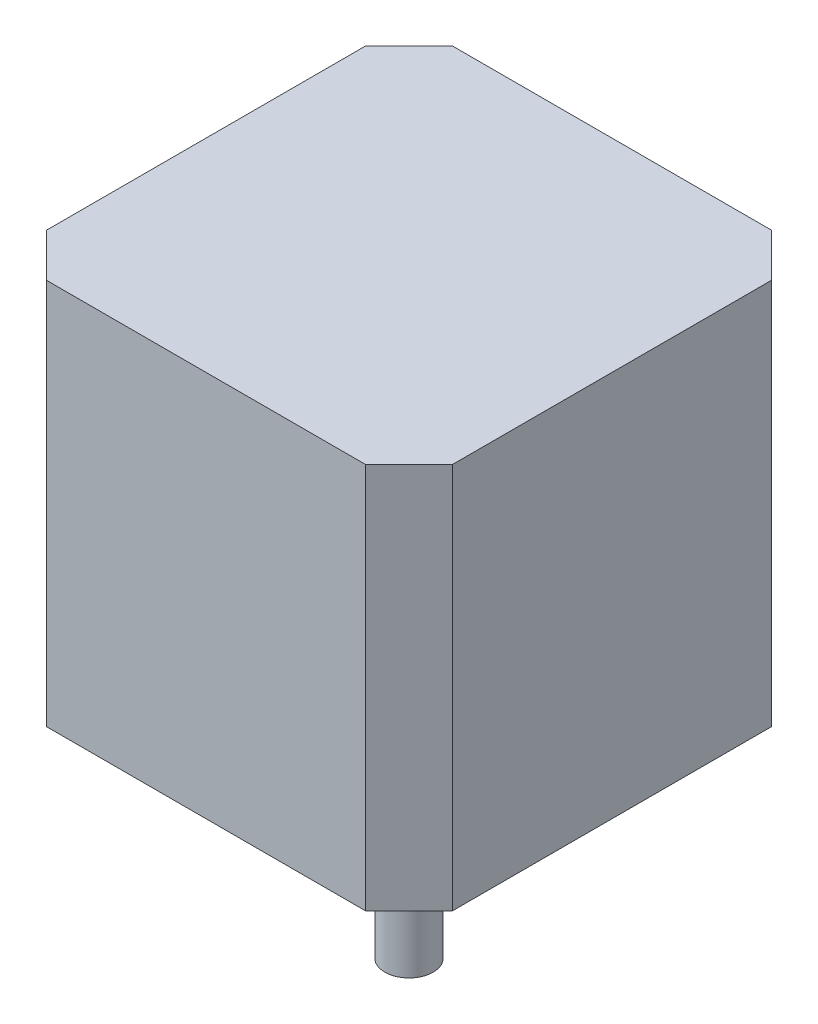
ISO-10303-21;
HEADER;
FILE_DESCRIPTION(('STEP AP214'),'2;1');
FILE_NAME('part.step','',(''),(''),'','','');
FILE_SCHEMA(('AUTOMOTIVE_DESIGN { 1 0 10303 214 1 1 1 1 }'));
ENDSEC;
DATA;
#1=APPLICATION_CONTEXT('core data for automotive mechanical design processes');
#2=APPLICATION_PROTOCOL_DEFINITION('international standard','automotive_design',2000,#1);
#3=PRODUCT_CONTEXT('',#1,'mechanical');
#4=PRODUCT('Part','Part','',(#3));
#5=PRODUCT_RELATED_PRODUCT_CATEGORY('part','',(#4));
#6=PRODUCT_DEFINITION_FORMATION('','',#4);
#7=PRODUCT_DEFINITION_CONTEXT('part definition',#1,'design');
#8=PRODUCT_DEFINITION('design','',#6,#7);
#9=PRODUCT_DEFINITION_SHAPE('','',#8);
#10=(LENGTH_UNIT() NAMED_UNIT(*) SI_UNIT(.MILLI.,.METRE.));
#11=(NAMED_UNIT(*) PLANE_ANGLE_UNIT() SI_UNIT($,.RADIAN.));
#12=(NAMED_UNIT(*) SI_UNIT($,.STERADIAN.) SOLID_ANGLE_UNIT());
#13=UNCERTAINTY_MEASURE_WITH_UNIT(LENGTH_MEASURE(1.E-05),#10,'distance_accuracy_value','');
#14=(GEOMETRIC_REPRESENTATION_CONTEXT(3) GLOBAL_UNCERTAINTY_ASSIGNED_CONTEXT((#13)) GLOBAL_UNIT_ASSIGNED_CONTEXT((#10,
#11,#12)) REPRESENTATION_CONTEXT('',''));
#15=CARTESIAN_POINT('',(0.,0.,0.));
#16=DIRECTION('',(0.,0.,1.));
#17=DIRECTION('',(1.,0.,0.));
#18=AXIS2_PLACEMENT_3D('',#15,#16,#17);
#19=CARTESIAN_POINT('',(21.,40.,21.));
#20=DIRECTION('',(0.,0.,-1.));
#21=DIRECTION('',(-1.,0.,0.));
#22=AXIS2_PLACEMENT_3D('',#19,#20,#21);
#23=PLANE('',#22);
#24=DIRECTION('',(1.,0.,0.));
#25=VECTOR('',#24,1.);
#26=CARTESIAN_POINT('',(21.,0.,21.));
#27=LINE('',#26,#25);
#28=CARTESIAN_POINT('',(-16.5,0.,21.));
#29=VERTEX_POINT('',#28);
#30=CARTESIAN_POINT('',(16.5,0.,21.));
#31=VERTEX_POINT('',#30);
#32=EDGE_CURVE('E155',#29,#31,#27,.T.);
#33=ORIENTED_EDGE('',*,*,#32,.T.);
#34=DIRECTION('',(0.,1.,0.));
#35=VECTOR('',#34,1.);
#36=CARTESIAN_POINT('',(16.5,40.,21.));
#37=LINE('',#36,#35);
#38=CARTESIAN_POINT('',(16.5,40.,21.));
#39=VERTEX_POINT('',#38);
#40=EDGE_CURVE('E194',#31,#39,#37,.T.);
#41=ORIENTED_EDGE('',*,*,#40,.T.);
#42=DIRECTION('',(1.,0.,0.));
#43=VECTOR('',#42,1.);
#44=CARTESIAN_POINT('',(21.,40.,21.));
#45=LINE('',#44,#43);
#46=CARTESIAN_POINT('',(-16.5,40.,21.));
#47=VERTEX_POINT('',#46);
#48=EDGE_CURVE('E158',#47,#39,#45,.T.);
#49=ORIENTED_EDGE('',*,*,#48,.F.);
#50=DIRECTION('',(0.,-1.,0.));
#51=VECTOR('',#50,1.);
#52=CARTESIAN_POINT('',(-16.5,40.,21.));
#53=LINE('',#52,#51);
#54=EDGE_CURVE('E191',#47,#29,#53,.T.);
#55=ORIENTED_EDGE('',*,*,#54,.T.);
#56=EDGE_LOOP('',(#33,#41,#49,#55));
#57=FACE_BOUND('',#56,.T.);
#58=ADVANCED_FACE('F36',(#57),#23,.F.);
#59=CARTESIAN_POINT('',(21.,40.,21.));
#60=DIRECTION('',(-1.,0.,0.));
#61=DIRECTION('',(0.,0.,1.));
#62=AXIS2_PLACEMENT_3D('',#59,#60,#61);
#63=PLANE('',#62);
#64=DIRECTION('',(0.,0.,-1.));
#65=VECTOR('',#64,1.);
#66=CARTESIAN_POINT('',(21.,40.,21.));
#67=LINE('',#66,#65);
#68=CARTESIAN_POINT('',(21.,40.,16.5));
#69=VERTEX_POINT('',#68);
#70=CARTESIAN_POINT('',(21.,40.,-16.5));
#71=VERTEX_POINT('',#70);
#72=EDGE_CURVE('E161',#69,#71,#67,.T.);
#73=ORIENTED_EDGE('',*,*,#72,.F.);
#74=DIRECTION('',(0.,-1.,0.));
#75=VECTOR('',#74,1.);
#76=CARTESIAN_POINT('',(21.,40.,16.5));
#77=LINE('',#76,#75);
#78=CARTESIAN_POINT('',(21.,0.,16.5));
#79=VERTEX_POINT('',#78);
#80=EDGE_CURVE('E180',#69,#79,#77,.T.);
#81=ORIENTED_EDGE('',*,*,#80,.T.);
#82=DIRECTION('',(0.,0.,-1.));
#83=VECTOR('',#82,1.);
#84=CARTESIAN_POINT('',(21.,0.,21.));
#85=LINE('',#84,#83);
#86=CARTESIAN_POINT('',(21.,0.,-16.5));
#87=VERTEX_POINT('',#86);
#88=EDGE_CURVE('E172',#79,#87,#85,.T.);
#89=ORIENTED_EDGE('',*,*,#88,.T.);
#90=DIRECTION('',(0.,1.,0.));
#91=VECTOR('',#90,1.);
#92=CARTESIAN_POINT('',(21.,40.,-16.5));
#93=LINE('',#92,#91);
#94=EDGE_CURVE('E169',#87,#71,#93,.T.);
#95=ORIENTED_EDGE('',*,*,#94,.T.);
#96=EDGE_LOOP('',(#73,#81,#89,#95));
#97=FACE_BOUND('',#96,.T.);
#98=ADVANCED_FACE('F237',(#97),#63,.F.);
#99=CARTESIAN_POINT('',(21.,40.,-21.));
#100=DIRECTION('',(0.,0.,1.));
#101=DIRECTION('',(1.,0.,0.));
#102=AXIS2_PLACEMENT_3D('',#99,#100,#101);
#103=PLANE('',#102);
#104=DIRECTION('',(-1.,0.,0.));
#105=VECTOR('',#104,1.);
#106=CARTESIAN_POINT('',(21.,40.,-21.));
#107=LINE('',#106,#105);
#108=CARTESIAN_POINT('',(16.5,40.,-21.));
#109=VERTEX_POINT('',#108);
#110=CARTESIAN_POINT('',(-16.5,40.,-21.));
#111=VERTEX_POINT('',#110);
#112=EDGE_CURVE('E165',#109,#111,#107,.T.);
#113=ORIENTED_EDGE('',*,*,#112,.F.);
#114=DIRECTION('',(0.,-1.,0.));
#115=VECTOR('',#114,1.);
#116=CARTESIAN_POINT('',(16.5,40.,-21.));
#117=LINE('',#116,#115);
#118=CARTESIAN_POINT('',(16.5,0.,-21.));
#119=VERTEX_POINT('',#118);
#120=EDGE_CURVE('E205',#109,#119,#117,.T.);
#121=ORIENTED_EDGE('',*,*,#120,.T.);
#122=DIRECTION('',(-1.,0.,0.));
#123=VECTOR('',#122,1.);
#124=CARTESIAN_POINT('',(21.,0.,-21.));
#125=LINE('',#124,#123);
#126=CARTESIAN_POINT('',(-16.5,0.,-21.));
#127=VERTEX_POINT('',#126);
#128=EDGE_CURVE('E175',#119,#127,#125,.T.);
#129=ORIENTED_EDGE('',*,*,#128,.T.);
#130=DIRECTION('',(0.,1.,0.));
#131=VECTOR('',#130,1.);
#132=CARTESIAN_POINT('',(-16.5,40.,-21.));
#133=LINE('',#132,#131);
#134=EDGE_CURVE('E203',#127,#111,#133,.T.);
#135=ORIENTED_EDGE('',*,*,#134,.T.);
#136=EDGE_LOOP('',(#113,#121,#129,#135));
#137=FACE_BOUND('',#136,.T.);
#138=ADVANCED_FACE('F211',(#137),#103,.F.);
#139=CARTESIAN_POINT('',(-21.,40.,21.));
#140=DIRECTION('',(1.,0.,0.));
#141=DIRECTION('',(0.,0.,-1.));
#142=AXIS2_PLACEMENT_3D('',#139,#140,#141);
#143=PLANE('',#142);
#144=DIRECTION('',(0.,0.,1.));
#145=VECTOR('',#144,1.);
#146=CARTESIAN_POINT('',(-21.,40.,21.));
#147=LINE('',#146,#145);
#148=CARTESIAN_POINT('',(-21.,40.,-16.5));
#149=VERTEX_POINT('',#148);
#150=CARTESIAN_POINT('',(-21.,40.,16.5));
#151=VERTEX_POINT('',#150);
#152=EDGE_CURVE('E167',#149,#151,#147,.T.);
#153=ORIENTED_EDGE('',*,*,#152,.F.);
#154=DIRECTION('',(0.,-1.,0.));
#155=VECTOR('',#154,1.);
#156=CARTESIAN_POINT('',(-21.,40.,-16.5));
#157=LINE('',#156,#155);
#158=CARTESIAN_POINT('',(-21.,0.,-16.5));
#159=VERTEX_POINT('',#158);
#160=EDGE_CURVE('E11',#149,#159,#157,.T.);
#161=ORIENTED_EDGE('',*,*,#160,.T.);
#162=DIRECTION('',(0.,0.,1.));
#163=VECTOR('',#162,1.);
#164=CARTESIAN_POINT('',(-21.,0.,21.));
#165=LINE('',#164,#163);
#166=CARTESIAN_POINT('',(-21.,0.,16.5));
#167=VERTEX_POINT('',#166);
#168=EDGE_CURVE('E162',#159,#167,#165,.T.);
#169=ORIENTED_EDGE('',*,*,#168,.T.);
#170=DIRECTION('',(0.,1.,0.));
#171=VECTOR('',#170,1.);
#172=CARTESIAN_POINT('',(-21.,40.,16.5));
#173=LINE('',#172,#171);
#174=EDGE_CURVE('E44',#167,#151,#173,.T.);
#175=ORIENTED_EDGE('',*,*,#174,.T.);
#176=EDGE_LOOP('',(#153,#161,#169,#175));
#177=FACE_BOUND('',#176,.T.);
#178=ADVANCED_FACE('F222',(#177),#143,.F.);
#179=CARTESIAN_POINT('',(0.,40.,0.));
#180=DIRECTION('',(0.,-1.,0.));
#181=DIRECTION('',(0.,0.,-1.));
#182=AXIS2_PLACEMENT_3D('',#179,#180,#181);
#183=PLANE('',#182);
#184=ORIENTED_EDGE('',*,*,#48,.T.);
#185=DIRECTION('',(-0.707106781186549,0.,0.707106781186546));
#186=VECTOR('',#185,1.);
#187=CARTESIAN_POINT('',(21.,40.,16.5));
#188=LINE('',#187,#186);
#189=EDGE_CURVE('E201',#39,#69,#188,.F.);
#190=ORIENTED_EDGE('',*,*,#189,.T.);
#191=ORIENTED_EDGE('',*,*,#72,.T.);
#192=DIRECTION('',(0.707106781186545,0.,0.70710678118655));
#193=VECTOR('',#192,1.);
#194=CARTESIAN_POINT('',(16.5,40.,-21.));
#195=LINE('',#194,#193);
#196=EDGE_CURVE('E199',#71,#109,#195,.F.);
#197=ORIENTED_EDGE('',*,*,#196,.T.);
#198=ORIENTED_EDGE('',*,*,#112,.T.);
#199=DIRECTION('',(0.707106781186549,0.,-0.707106781186546));
#200=VECTOR('',#199,1.);
#201=CARTESIAN_POINT('',(-21.,40.,-16.5));
#202=LINE('',#201,#200);
#203=EDGE_CURVE('E57',#111,#149,#202,.F.);
#204=ORIENTED_EDGE('',*,*,#203,.T.);
#205=ORIENTED_EDGE('',*,*,#152,.T.);
#206=DIRECTION('',(-0.707106781186547,0.,-0.707106781186548));
#207=VECTOR('',#206,1.);
#208=CARTESIAN_POINT('',(-16.5,40.,21.));
#209=LINE('',#208,#207);
#210=EDGE_CURVE('E196',#151,#47,#209,.F.);
#211=ORIENTED_EDGE('',*,*,#210,.T.);
#212=EDGE_LOOP('',(#184,#190,#191,#197,#198,#204,#205,#211));
#213=FACE_BOUND('',#212,.T.);
#214=ADVANCED_FACE('F224',(#213),#183,.F.);
#215=CARTESIAN_POINT('',(0.,0.,0.));
#216=DIRECTION('',(0.,-1.,0.));
#217=DIRECTION('',(0.,0.,-1.));
#218=AXIS2_PLACEMENT_3D('',#215,#216,#217);
#219=PLANE('',#218);
#220=CARTESIAN_POINT('',(-15.5,0.,-15.5));
#221=DIRECTION('',(0.,-1.,0.));
#222=DIRECTION('',(0.,0.,-1.));
#223=AXIS2_PLACEMENT_3D('',#220,#221,#222);
#224=CIRCLE('',#223,1.24999999999999);
#225=CARTESIAN_POINT('',(-15.5,0.,-16.75));
#226=VERTEX_POINT('',#225);
#227=EDGE_CURVE('E123',#226,#226,#224,.T.);
#228=ORIENTED_EDGE('',*,*,#227,.F.);
#229=EDGE_LOOP('',(#228));
#230=FACE_BOUND('',#229,.T.);
#231=CARTESIAN_POINT('',(15.5,0.,-15.5));
#232=DIRECTION('',(0.,-1.,0.));
#233=DIRECTION('',(0.,0.,-1.));
#234=AXIS2_PLACEMENT_3D('',#231,#232,#233);
#235=CIRCLE('',#234,1.24999999999999);
#236=CARTESIAN_POINT('',(15.5,0.,-16.75));
#237=VERTEX_POINT('',#236);
#238=EDGE_CURVE('E122',#237,#237,#235,.T.);
#239=ORIENTED_EDGE('',*,*,#238,.F.);
#240=EDGE_LOOP('',(#239));
#241=FACE_BOUND('',#240,.T.);
#242=CARTESIAN_POINT('',(15.5,0.,15.5));
#243=DIRECTION('',(0.,-1.,0.));
#244=DIRECTION('',(0.,0.,-1.));
#245=AXIS2_PLACEMENT_3D('',#242,#243,#244);
#246=CIRCLE('',#245,1.24999999999999);
#247=CARTESIAN_POINT('',(15.5,0.,14.25));
#248=VERTEX_POINT('',#247);
#249=EDGE_CURVE('E133',#248,#248,#246,.T.);
#250=ORIENTED_EDGE('',*,*,#249,.F.);
#251=EDGE_LOOP('',(#250));
#252=FACE_BOUND('',#251,.T.);
#253=CARTESIAN_POINT('',(-15.5,0.,15.5));
#254=DIRECTION('',(0.,-1.,0.));
#255=DIRECTION('',(0.,0.,-1.));
#256=AXIS2_PLACEMENT_3D('',#253,#254,#255);
#257=CIRCLE('',#256,1.24999999999999);
#258=CARTESIAN_POINT('',(-15.5,0.,14.25));
#259=VERTEX_POINT('',#258);
#260=EDGE_CURVE('E139',#259,#259,#257,.T.);
#261=ORIENTED_EDGE('',*,*,#260,.F.);
#262=EDGE_LOOP('',(#261));
#263=FACE_BOUND('',#262,.T.);
#264=CARTESIAN_POINT('',(0.,0.,0.));
#265=DIRECTION('',(0.,-1.,0.));
#266=DIRECTION('',(0.,0.,-1.));
#267=AXIS2_PLACEMENT_3D('',#264,#265,#266);
#268=CIRCLE('',#267,11.);
#269=CARTESIAN_POINT('',(0.,0.,-11.));
#270=VERTEX_POINT('',#269);
#271=EDGE_CURVE('E149',#270,#270,#268,.T.);
#272=ORIENTED_EDGE('',*,*,#271,.F.);
#273=EDGE_LOOP('',(#272));
#274=FACE_BOUND('',#273,.T.);
#275=ORIENTED_EDGE('',*,*,#88,.F.);
#276=DIRECTION('',(0.707106781186549,0.,-0.707106781186546));
#277=VECTOR('',#276,1.);
#278=CARTESIAN_POINT('',(18.75,0.,18.75));
#279=LINE('',#278,#277);
#280=EDGE_CURVE('E189',#79,#31,#279,.F.);
#281=ORIENTED_EDGE('',*,*,#280,.T.);
#282=ORIENTED_EDGE('',*,*,#32,.F.);
#283=DIRECTION('',(0.707106781186547,0.,0.707106781186548));
#284=VECTOR('',#283,1.);
#285=CARTESIAN_POINT('',(-18.75,0.,18.75));
#286=LINE('',#285,#284);
#287=EDGE_CURVE('E183',#29,#167,#286,.F.);
#288=ORIENTED_EDGE('',*,*,#287,.T.);
#289=ORIENTED_EDGE('',*,*,#168,.F.);
#290=DIRECTION('',(-0.707106781186549,0.,0.707106781186546));
#291=VECTOR('',#290,1.);
#292=CARTESIAN_POINT('',(-18.75,0.,-18.75));
#293=LINE('',#292,#291);
#294=EDGE_CURVE('E185',#159,#127,#293,.F.);
#295=ORIENTED_EDGE('',*,*,#294,.T.);
#296=ORIENTED_EDGE('',*,*,#128,.F.);
#297=DIRECTION('',(-0.707106781186545,0.,-0.70710678118655));
#298=VECTOR('',#297,1.);
#299=CARTESIAN_POINT('',(18.7500000000001,0.,-18.7499999999999));
#300=LINE('',#299,#298);
#301=EDGE_CURVE('E187',#119,#87,#300,.F.);
#302=ORIENTED_EDGE('',*,*,#301,.T.);
#303=EDGE_LOOP('',(#275,#281,#282,#288,#289,#295,#296,#302));
#304=FACE_BOUND('',#303,.T.);
#305=ADVANCED_FACE('F217',(#230,#241,#252,#263,#274,#304),#219,.T.);
#306=CARTESIAN_POINT('',(0.,-2.,0.));
#307=DIRECTION('',(0.,1.,0.));
#308=DIRECTION('',(0.,0.,1.));
#309=AXIS2_PLACEMENT_3D('',#306,#307,#308);
#310=CYLINDRICAL_SURFACE('',#309,11.);
#311=CARTESIAN_POINT('',(0.,-2.,0.));
#312=DIRECTION('',(0.,-1.,0.));
#313=DIRECTION('',(0.,0.,-1.));
#314=AXIS2_PLACEMENT_3D('',#311,#312,#313);
#315=CIRCLE('',#314,11.);
#316=CARTESIAN_POINT('',(0.,-2.,-11.));
#317=VERTEX_POINT('',#316);
#318=EDGE_CURVE('E152',#317,#317,#315,.T.);
#319=ORIENTED_EDGE('',*,*,#318,.F.);
#320=EDGE_LOOP('',(#319));
#321=FACE_BOUND('',#320,.T.);
#322=ORIENTED_EDGE('',*,*,#271,.T.);
#323=EDGE_LOOP('',(#322));
#324=FACE_BOUND('',#323,.T.);
#325=ADVANCED_FACE('F261',(#321,#324),#310,.T.);
#326=CARTESIAN_POINT('',(0.,-2.,0.));
#327=DIRECTION('',(0.,-1.,0.));
#328=DIRECTION('',(0.,0.,-1.));
#329=AXIS2_PLACEMENT_3D('',#326,#327,#328);
#330=PLANE('',#329);
#331=CARTESIAN_POINT('',(0.,-2.,0.));
#332=DIRECTION('',(0.,-1.,0.));
#333=DIRECTION('',(0.,0.,-1.));
#334=AXIS2_PLACEMENT_3D('',#331,#332,#333);
#335=CIRCLE('',#334,2.5);
#336=CARTESIAN_POINT('',(0.,-2.,-2.5));
#337=VERTEX_POINT('',#336);
#338=EDGE_CURVE('E145',#337,#337,#335,.T.);
#339=ORIENTED_EDGE('',*,*,#338,.F.);
#340=EDGE_LOOP('',(#339));
#341=FACE_BOUND('',#340,.T.);
#342=ORIENTED_EDGE('',*,*,#318,.T.);
#343=EDGE_LOOP('',(#342));
#344=FACE_BOUND('',#343,.T.);
#345=ADVANCED_FACE('F267',(#341,#344),#330,.T.);
#346=CARTESIAN_POINT('',(0.,-23.,0.));
#347=DIRECTION('',(0.,1.,0.));
#348=DIRECTION('',(0.,0.,1.));
#349=AXIS2_PLACEMENT_3D('',#346,#347,#348);
#350=CYLINDRICAL_SURFACE('',#349,2.5);
#351=CARTESIAN_POINT('',(0.,-23.,0.));
#352=DIRECTION('',(0.,-1.,0.));
#353=DIRECTION('',(0.,0.,-1.));
#354=AXIS2_PLACEMENT_3D('',#351,#352,#353);
#355=CIRCLE('',#354,2.5);
#356=CARTESIAN_POINT('',(0.,-23.,-2.5));
#357=VERTEX_POINT('',#356);
#358=EDGE_CURVE('E146',#357,#357,#355,.T.);
#359=ORIENTED_EDGE('',*,*,#358,.F.);
#360=EDGE_LOOP('',(#359));
#361=FACE_BOUND('',#360,.T.);
#362=ORIENTED_EDGE('',*,*,#338,.T.);
#363=EDGE_LOOP('',(#362));
#364=FACE_BOUND('',#363,.T.);
#365=ADVANCED_FACE('F271',(#361,#364),#350,.T.);
#366=CARTESIAN_POINT('',(0.,-23.,0.));
#367=DIRECTION('',(0.,-1.,0.));
#368=DIRECTION('',(0.,0.,-1.));
#369=AXIS2_PLACEMENT_3D('',#366,#367,#368);
#370=PLANE('',#369);
#371=ORIENTED_EDGE('',*,*,#358,.T.);
#372=EDGE_LOOP('',(#371));
#373=FACE_BOUND('',#372,.T.);
#374=ADVANCED_FACE('F246',(#373),#370,.T.);
#375=CARTESIAN_POINT('',(21.,40.,16.5));
#376=DIRECTION('',(-0.707106781186546,0.,-0.707106781186549));
#377=DIRECTION('',(0.,-1.,0.));
#378=AXIS2_PLACEMENT_3D('',#375,#376,#377);
#379=PLANE('',#378);
#380=ORIENTED_EDGE('',*,*,#189,.F.);
#381=ORIENTED_EDGE('',*,*,#40,.F.);
#382=ORIENTED_EDGE('',*,*,#280,.F.);
#383=ORIENTED_EDGE('',*,*,#80,.F.);
#384=EDGE_LOOP('',(#380,#381,#382,#383));
#385=FACE_BOUND('',#384,.T.);
#386=ADVANCED_FACE('F234',(#385),#379,.F.);
#387=CARTESIAN_POINT('',(16.5,40.,-21.));
#388=DIRECTION('',(-0.70710678118655,0.,0.707106781186545));
#389=DIRECTION('',(0.,-1.,0.));
#390=AXIS2_PLACEMENT_3D('',#387,#388,#389);
#391=PLANE('',#390);
#392=ORIENTED_EDGE('',*,*,#196,.F.);
#393=ORIENTED_EDGE('',*,*,#94,.F.);
#394=ORIENTED_EDGE('',*,*,#301,.F.);
#395=ORIENTED_EDGE('',*,*,#120,.F.);
#396=EDGE_LOOP('',(#392,#393,#394,#395));
#397=FACE_BOUND('',#396,.T.);
#398=ADVANCED_FACE('F239',(#397),#391,.F.);
#399=CARTESIAN_POINT('',(-21.,40.,-16.5));
#400=DIRECTION('',(0.707106781186546,0.,0.707106781186549));
#401=DIRECTION('',(0.,-1.,0.));
#402=AXIS2_PLACEMENT_3D('',#399,#400,#401);
#403=PLANE('',#402);
#404=ORIENTED_EDGE('',*,*,#203,.F.);
#405=ORIENTED_EDGE('',*,*,#134,.F.);
#406=ORIENTED_EDGE('',*,*,#294,.F.);
#407=ORIENTED_EDGE('',*,*,#160,.F.);
#408=EDGE_LOOP('',(#404,#405,#406,#407));
#409=FACE_BOUND('',#408,.T.);
#410=ADVANCED_FACE('F221',(#409),#403,.F.);
#411=CARTESIAN_POINT('',(-16.5,40.,21.));
#412=DIRECTION('',(0.707106781186548,0.,-0.707106781186547));
#413=DIRECTION('',(0.,-1.,0.));
#414=AXIS2_PLACEMENT_3D('',#411,#412,#413);
#415=PLANE('',#414);
#416=ORIENTED_EDGE('',*,*,#210,.F.);
#417=ORIENTED_EDGE('',*,*,#174,.F.);
#418=ORIENTED_EDGE('',*,*,#287,.F.);
#419=ORIENTED_EDGE('',*,*,#54,.F.);
#420=EDGE_LOOP('',(#416,#417,#418,#419));
#421=FACE_BOUND('',#420,.T.);
#422=ADVANCED_FACE('F38',(#421),#415,.F.);
#423=CARTESIAN_POINT('',(-15.5,6.,15.5));
#424=DIRECTION('',(0.,-1.,0.));
#425=DIRECTION('',(0.,0.,-1.));
#426=AXIS2_PLACEMENT_3D('',#423,#424,#425);
#427=CONICAL_SURFACE('',#426,1.25,1.02974425867665);
#428=CARTESIAN_POINT('',(-15.5,6.75107577378445,15.5));
#429=VERTEX_POINT('',#428);
#430=VERTEX_LOOP('',#429);
#431=FACE_BOUND('',#430,.T.);
#432=CARTESIAN_POINT('',(-15.5,6.,15.5));
#433=DIRECTION('',(0.,-1.,0.));
#434=DIRECTION('',(0.,0.,-1.));
#435=AXIS2_PLACEMENT_3D('',#432,#433,#434);
#436=CIRCLE('',#435,1.25);
#437=CARTESIAN_POINT('',(-15.5,6.,14.25));
#438=VERTEX_POINT('',#437);
#439=EDGE_CURVE('E142',#438,#438,#436,.T.);
#440=ORIENTED_EDGE('',*,*,#439,.T.);
#441=EDGE_LOOP('',(#440));
#442=FACE_BOUND('',#441,.T.);
#443=ADVANCED_FACE('F279',(#431,#442),#427,.F.);
#444=CARTESIAN_POINT('',(-15.5,0.,15.5));
#445=DIRECTION('',(0.,-1.,0.));
#446=DIRECTION('',(0.,0.,-1.));
#447=AXIS2_PLACEMENT_3D('',#444,#445,#446);
#448=CYLINDRICAL_SURFACE('',#447,1.24999999999999);
#449=ORIENTED_EDGE('',*,*,#439,.F.);
#450=EDGE_LOOP('',(#449));
#451=FACE_BOUND('',#450,.T.);
#452=ORIENTED_EDGE('',*,*,#260,.T.);
#453=EDGE_LOOP('',(#452));
#454=FACE_BOUND('',#453,.T.);
#455=ADVANCED_FACE('F282',(#451,#454),#448,.F.);
#456=CARTESIAN_POINT('',(15.5,6.,15.5));
#457=DIRECTION('',(0.,-1.,0.));
#458=DIRECTION('',(0.,0.,-1.));
#459=AXIS2_PLACEMENT_3D('',#456,#457,#458);
#460=CONICAL_SURFACE('',#459,1.25,1.02974425867665);
#461=CARTESIAN_POINT('',(15.5,6.75107577378445,15.5));
#462=VERTEX_POINT('',#461);
#463=VERTEX_LOOP('',#462);
#464=FACE_BOUND('',#463,.T.);
#465=CARTESIAN_POINT('',(15.5,6.,15.5));
#466=DIRECTION('',(0.,-1.,0.));
#467=DIRECTION('',(0.,0.,-1.));
#468=AXIS2_PLACEMENT_3D('',#465,#466,#467);
#469=CIRCLE('',#468,1.25);
#470=CARTESIAN_POINT('',(15.5,6.,14.25));
#471=VERTEX_POINT('',#470);
#472=EDGE_CURVE('E136',#471,#471,#469,.T.);
#473=ORIENTED_EDGE('',*,*,#472,.T.);
#474=EDGE_LOOP('',(#473));
#475=FACE_BOUND('',#474,.T.);
#476=ADVANCED_FACE('F286',(#464,#475),#460,.F.);
#477=CARTESIAN_POINT('',(15.5,0.,15.5));
#478=DIRECTION('',(0.,-1.,0.));
#479=DIRECTION('',(0.,0.,-1.));
#480=AXIS2_PLACEMENT_3D('',#477,#478,#479);
#481=CYLINDRICAL_SURFACE('',#480,1.24999999999999);
#482=ORIENTED_EDGE('',*,*,#472,.F.);
#483=EDGE_LOOP('',(#482));
#484=FACE_BOUND('',#483,.T.);
#485=ORIENTED_EDGE('',*,*,#249,.T.);
#486=EDGE_LOOP('',(#485));
#487=FACE_BOUND('',#486,.T.);
#488=ADVANCED_FACE('F290',(#484,#487),#481,.F.);
#489=CARTESIAN_POINT('',(15.5,6.,-15.5));
#490=DIRECTION('',(0.,-1.,0.));
#491=DIRECTION('',(0.,0.,-1.));
#492=AXIS2_PLACEMENT_3D('',#489,#490,#491);
#493=CONICAL_SURFACE('',#492,1.25,1.02974425867665);
#494=CARTESIAN_POINT('',(15.5,6.75107577378445,-15.5));
#495=VERTEX_POINT('',#494);
#496=VERTEX_LOOP('',#495);
#497=FACE_BOUND('',#496,.T.);
#498=CARTESIAN_POINT('',(15.5,6.,-15.5));
#499=DIRECTION('',(0.,-1.,0.));
#500=DIRECTION('',(0.,0.,-1.));
#501=AXIS2_PLACEMENT_3D('',#498,#499,#500);
#502=CIRCLE('',#501,1.25);
#503=CARTESIAN_POINT('',(15.5,6.,-16.75));
#504=VERTEX_POINT('',#503);
#505=EDGE_CURVE('E126',#504,#504,#502,.T.);
#506=ORIENTED_EDGE('',*,*,#505,.T.);
#507=EDGE_LOOP('',(#506));
#508=FACE_BOUND('',#507,.T.);
#509=ADVANCED_FACE('F294',(#497,#508),#493,.F.);
#510=CARTESIAN_POINT('',(15.5,0.,-15.5));
#511=DIRECTION('',(0.,-1.,0.));
#512=DIRECTION('',(0.,0.,-1.));
#513=AXIS2_PLACEMENT_3D('',#510,#511,#512);
#514=CYLINDRICAL_SURFACE('',#513,1.24999999999999);
#515=ORIENTED_EDGE('',*,*,#505,.F.);
#516=EDGE_LOOP('',(#515));
#517=FACE_BOUND('',#516,.T.);
#518=ORIENTED_EDGE('',*,*,#238,.T.);
#519=EDGE_LOOP('',(#518));
#520=FACE_BOUND('',#519,.T.);
#521=ADVANCED_FACE('F116',(#517,#520),#514,.F.);
#522=CARTESIAN_POINT('',(-15.5,6.,-15.5));
#523=DIRECTION('',(0.,-1.,0.));
#524=DIRECTION('',(0.,0.,-1.));
#525=AXIS2_PLACEMENT_3D('',#522,#523,#524);
#526=CONICAL_SURFACE('',#525,1.25,1.02974425867665);
#527=CARTESIAN_POINT('',(-15.5,6.75107577378445,-15.5));
#528=VERTEX_POINT('',#527);
#529=VERTEX_LOOP('',#528);
#530=FACE_BOUND('',#529,.T.);
#531=CARTESIAN_POINT('',(-15.5,6.,-15.5));
#532=DIRECTION('',(0.,-1.,0.));
#533=DIRECTION('',(0.,0.,-1.));
#534=AXIS2_PLACEMENT_3D('',#531,#532,#533);
#535=CIRCLE('',#534,1.25);
#536=CARTESIAN_POINT('',(-15.5,6.,-16.75));
#537=VERTEX_POINT('',#536);
#538=EDGE_CURVE('E120',#537,#537,#535,.T.);
#539=ORIENTED_EDGE('',*,*,#538,.T.);
#540=EDGE_LOOP('',(#539));
#541=FACE_BOUND('',#540,.T.);
#542=ADVANCED_FACE('F112',(#530,#541),#526,.F.);
#543=CARTESIAN_POINT('',(-15.5,0.,-15.5));
#544=DIRECTION('',(0.,-1.,0.));
#545=DIRECTION('',(0.,0.,-1.));
#546=AXIS2_PLACEMENT_3D('',#543,#544,#545);
#547=CYLINDRICAL_SURFACE('',#546,1.24999999999999);
#548=ORIENTED_EDGE('',*,*,#538,.F.);
#549=EDGE_LOOP('',(#548));
#550=FACE_BOUND('',#549,.T.);
#551=ORIENTED_EDGE('',*,*,#227,.T.);
#552=EDGE_LOOP('',(#551));
#553=FACE_BOUND('',#552,.T.);
#554=ADVANCED_FACE('F115',(#550,#553),#547,.F.);
#555=CLOSED_SHELL('',(#58,#98,#138,#178,#214,#305,#325,#345,#365,#374,#386,#398,#410,#422,#443,
#455,#476,#488,#509,#521,#542,#554));
#556=MANIFOLD_SOLID_BREP('B2',#555);
#557=ADVANCED_BREP_SHAPE_REPRESENTATION('',(#18,#556),#14);
#558=SHAPE_DEFINITION_REPRESENTATION(#9,#557);
ENDSEC;
END-ISO-10303-21;
